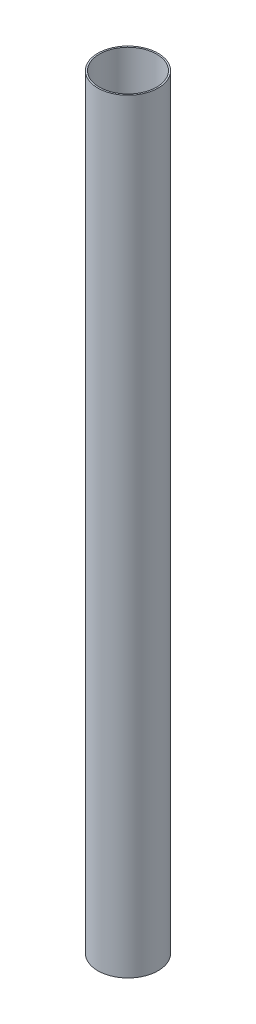
ISO-10303-21;
HEADER;
FILE_DESCRIPTION(('STEP AP214'),'2;1');
FILE_NAME('part.step','',(''),(''),'','','');
FILE_SCHEMA(('AUTOMOTIVE_DESIGN { 1 0 10303 214 1 1 1 1 }'));
ENDSEC;
DATA;
#1=APPLICATION_CONTEXT('core data for automotive mechanical design processes');
#2=APPLICATION_PROTOCOL_DEFINITION('international standard','automotive_design',2000,#1);
#3=PRODUCT_CONTEXT('',#1,'mechanical');
#4=PRODUCT('Part','Part','',(#3));
#5=PRODUCT_RELATED_PRODUCT_CATEGORY('part','',(#4));
#6=PRODUCT_DEFINITION_FORMATION('','',#4);
#7=PRODUCT_DEFINITION_CONTEXT('part definition',#1,'design');
#8=PRODUCT_DEFINITION('design','',#6,#7);
#9=PRODUCT_DEFINITION_SHAPE('','',#8);
#10=(LENGTH_UNIT() NAMED_UNIT(*) SI_UNIT(.MILLI.,.METRE.));
#11=(NAMED_UNIT(*) PLANE_ANGLE_UNIT() SI_UNIT($,.RADIAN.));
#12=(NAMED_UNIT(*) SI_UNIT($,.STERADIAN.) SOLID_ANGLE_UNIT());
#13=UNCERTAINTY_MEASURE_WITH_UNIT(LENGTH_MEASURE(1.E-05),#10,'distance_accuracy_value','');
#14=(GEOMETRIC_REPRESENTATION_CONTEXT(3) GLOBAL_UNCERTAINTY_ASSIGNED_CONTEXT((#13)) GLOBAL_UNIT_ASSIGNED_CONTEXT((#10,
#11,#12)) REPRESENTATION_CONTEXT('',''));
#15=CARTESIAN_POINT('',(0.,0.,0.));
#16=DIRECTION('',(0.,0.,1.));
#17=DIRECTION('',(1.,0.,0.));
#18=AXIS2_PLACEMENT_3D('',#15,#16,#17);
#19=CARTESIAN_POINT('',(0.,253.5,0.));
#20=DIRECTION('',(0.,1.,0.));
#21=DIRECTION('',(0.,0.,1.));
#22=AXIS2_PLACEMENT_3D('',#19,#20,#21);
#23=PLANE('',#22);
#24=CARTESIAN_POINT('',(0.,253.5,0.));
#25=DIRECTION('',(0.,1.,0.));
#26=DIRECTION('',(0.,0.,1.));
#27=AXIS2_PLACEMENT_3D('',#24,#25,#26);
#28=CIRCLE('',#27,10.);
#29=CARTESIAN_POINT('',(0.,253.5,10.));
#30=VERTEX_POINT('',#29);
#31=EDGE_CURVE('E10',#30,#30,#28,.T.);
#32=ORIENTED_EDGE('',*,*,#31,.T.);
#33=EDGE_LOOP('',(#32));
#34=FACE_BOUND('',#33,.T.);
#35=CARTESIAN_POINT('',(0.,253.5,0.));
#36=DIRECTION('',(0.,1.,0.));
#37=DIRECTION('',(0.,0.,1.));
#38=AXIS2_PLACEMENT_3D('',#35,#36,#37);
#39=CIRCLE('',#38,9.5);
#40=CARTESIAN_POINT('',(0.,253.5,9.5));
#41=VERTEX_POINT('',#40);
#42=EDGE_CURVE('E43',#41,#41,#39,.T.);
#43=ORIENTED_EDGE('',*,*,#42,.F.);
#44=EDGE_LOOP('',(#43));
#45=FACE_BOUND('',#44,.T.);
#46=ADVANCED_FACE('F32',(#34,#45),#23,.T.);
#47=CARTESIAN_POINT('',(0.,0.,0.));
#48=DIRECTION('',(0.,1.,0.));
#49=DIRECTION('',(0.,0.,1.));
#50=AXIS2_PLACEMENT_3D('',#47,#48,#49);
#51=PLANE('',#50);
#52=CARTESIAN_POINT('',(0.,0.,0.));
#53=DIRECTION('',(0.,1.,0.));
#54=DIRECTION('',(0.,0.,1.));
#55=AXIS2_PLACEMENT_3D('',#52,#53,#54);
#56=CIRCLE('',#55,10.);
#57=CARTESIAN_POINT('',(0.,0.,10.));
#58=VERTEX_POINT('',#57);
#59=EDGE_CURVE('E36',#58,#58,#56,.T.);
#60=ORIENTED_EDGE('',*,*,#59,.F.);
#61=EDGE_LOOP('',(#60));
#62=FACE_BOUND('',#61,.T.);
#63=CARTESIAN_POINT('',(0.,0.,0.));
#64=DIRECTION('',(0.,1.,0.));
#65=DIRECTION('',(0.,0.,1.));
#66=AXIS2_PLACEMENT_3D('',#63,#64,#65);
#67=CIRCLE('',#66,9.5);
#68=CARTESIAN_POINT('',(0.,0.,9.5));
#69=VERTEX_POINT('',#68);
#70=EDGE_CURVE('E45',#69,#69,#67,.T.);
#71=ORIENTED_EDGE('',*,*,#70,.T.);
#72=EDGE_LOOP('',(#71));
#73=FACE_BOUND('',#72,.T.);
#74=ADVANCED_FACE('F55',(#62,#73),#51,.F.);
#75=CARTESIAN_POINT('',(0.,253.5,0.));
#76=DIRECTION('',(0.,-1.,0.));
#77=DIRECTION('',(0.,0.,-1.));
#78=AXIS2_PLACEMENT_3D('',#75,#76,#77);
#79=CYLINDRICAL_SURFACE('',#78,10.);
#80=ORIENTED_EDGE('',*,*,#31,.F.);
#81=EDGE_LOOP('',(#80));
#82=FACE_BOUND('',#81,.T.);
#83=ORIENTED_EDGE('',*,*,#59,.T.);
#84=EDGE_LOOP('',(#83));
#85=FACE_BOUND('',#84,.T.);
#86=ADVANCED_FACE('F34',(#82,#85),#79,.T.);
#87=CARTESIAN_POINT('',(0.,253.5,0.));
#88=DIRECTION('',(0.,-1.,0.));
#89=DIRECTION('',(0.,0.,-1.));
#90=AXIS2_PLACEMENT_3D('',#87,#88,#89);
#91=CYLINDRICAL_SURFACE('',#90,9.5);
#92=ORIENTED_EDGE('',*,*,#42,.T.);
#93=EDGE_LOOP('',(#92));
#94=FACE_BOUND('',#93,.T.);
#95=ORIENTED_EDGE('',*,*,#70,.F.);
#96=EDGE_LOOP('',(#95));
#97=FACE_BOUND('',#96,.T.);
#98=ADVANCED_FACE('F51',(#94,#97),#91,.F.);
#99=CLOSED_SHELL('',(#46,#74,#86,#98));
#100=MANIFOLD_SOLID_BREP('B2',#99);
#101=ADVANCED_BREP_SHAPE_REPRESENTATION('',(#18,#100),#14);
#102=SHAPE_DEFINITION_REPRESENTATION(#9,#101);
ENDSEC;
END-ISO-10303-21;
